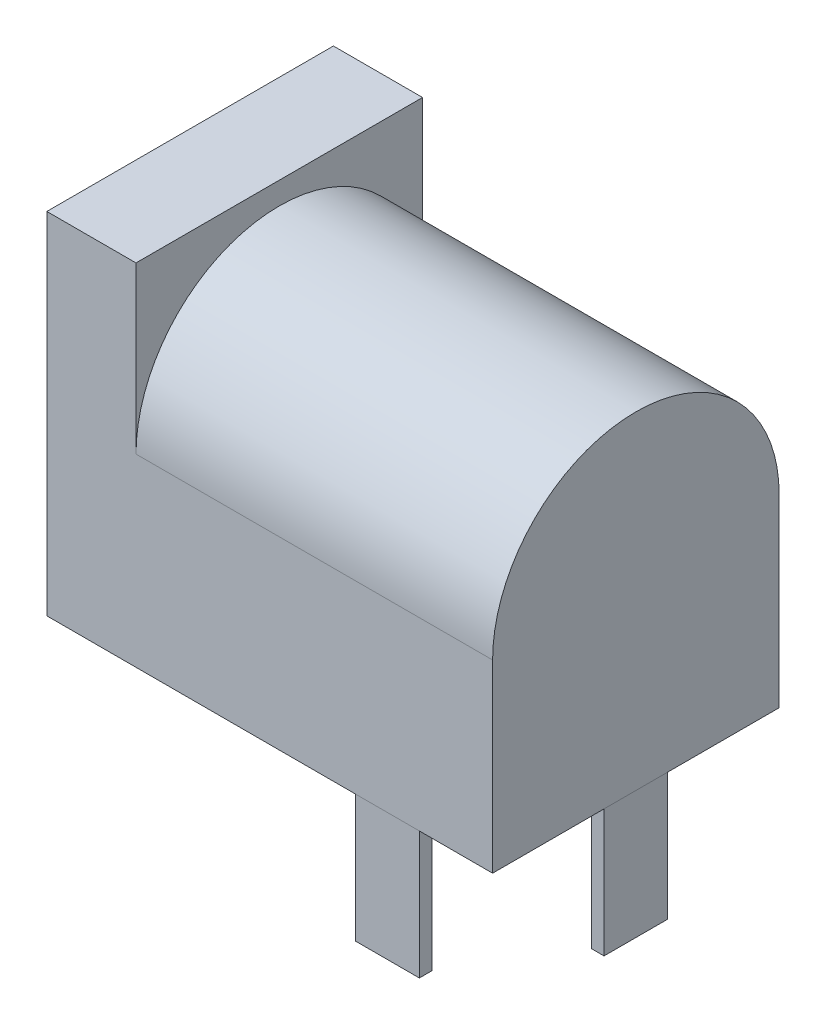
ISO-10303-21;
HEADER;
FILE_DESCRIPTION(('STEP AP214'),'2;1');
FILE_NAME('part.step','',(''),(''),'','','');
FILE_SCHEMA(('AUTOMOTIVE_DESIGN { 1 0 10303 214 1 1 1 1 }'));
ENDSEC;
DATA;
#1=APPLICATION_CONTEXT('core data for automotive mechanical design processes');
#2=APPLICATION_PROTOCOL_DEFINITION('international standard','automotive_design',2000,#1);
#3=PRODUCT_CONTEXT('',#1,'mechanical');
#4=PRODUCT('Part','Part','',(#3));
#5=PRODUCT_RELATED_PRODUCT_CATEGORY('part','',(#4));
#6=PRODUCT_DEFINITION_FORMATION('','',#4);
#7=PRODUCT_DEFINITION_CONTEXT('part definition',#1,'design');
#8=PRODUCT_DEFINITION('design','',#6,#7);
#9=PRODUCT_DEFINITION_SHAPE('','',#8);
#10=(LENGTH_UNIT() NAMED_UNIT(*) SI_UNIT(.MILLI.,.METRE.));
#11=(NAMED_UNIT(*) PLANE_ANGLE_UNIT() SI_UNIT($,.RADIAN.));
#12=(NAMED_UNIT(*) SI_UNIT($,.STERADIAN.) SOLID_ANGLE_UNIT());
#13=UNCERTAINTY_MEASURE_WITH_UNIT(LENGTH_MEASURE(1.E-05),#10,'distance_accuracy_value','');
#14=(GEOMETRIC_REPRESENTATION_CONTEXT(3) GLOBAL_UNCERTAINTY_ASSIGNED_CONTEXT((#13)) GLOBAL_UNIT_ASSIGNED_CONTEXT((#10,
#11,#12)) REPRESENTATION_CONTEXT('',''));
#15=CARTESIAN_POINT('',(0.,0.,0.));
#16=DIRECTION('',(0.,0.,1.));
#17=DIRECTION('',(1.,0.,0.));
#18=AXIS2_PLACEMENT_3D('',#15,#16,#17);
#19=CARTESIAN_POINT('',(7.4,-4.,1.));
#20=DIRECTION('',(1.,0.,0.));
#21=DIRECTION('',(0.,0.,-1.));
#22=AXIS2_PLACEMENT_3D('',#19,#20,#21);
#23=PLANE('',#22);
#24=DIRECTION('',(0.,0.,-1.));
#25=VECTOR('',#24,1.);
#26=CARTESIAN_POINT('',(7.4,0.,1.));
#27=LINE('',#26,#25);
#28=CARTESIAN_POINT('',(7.4,0.,1.));
#29=VERTEX_POINT('',#28);
#30=CARTESIAN_POINT('',(7.4,0.,-1.));
#31=VERTEX_POINT('',#30);
#32=EDGE_CURVE('E109',#29,#31,#27,.T.);
#33=ORIENTED_EDGE('',*,*,#32,.T.);
#34=DIRECTION('',(0.,1.,0.));
#35=VECTOR('',#34,1.);
#36=CARTESIAN_POINT('',(7.4,-4.,-1.));
#37=LINE('',#36,#35);
#38=CARTESIAN_POINT('',(7.4,-4.,-1.));
#39=VERTEX_POINT('',#38);
#40=EDGE_CURVE('E13',#39,#31,#37,.T.);
#41=ORIENTED_EDGE('',*,*,#40,.F.);
#42=DIRECTION('',(0.,0.,-1.));
#43=VECTOR('',#42,1.);
#44=CARTESIAN_POINT('',(7.4,-4.,1.));
#45=LINE('',#44,#43);
#46=CARTESIAN_POINT('',(7.4,-4.,1.));
#47=VERTEX_POINT('',#46);
#48=EDGE_CURVE('E97',#47,#39,#45,.T.);
#49=ORIENTED_EDGE('',*,*,#48,.F.);
#50=DIRECTION('',(0.,1.,0.));
#51=VECTOR('',#50,1.);
#52=CARTESIAN_POINT('',(7.4,-4.,1.));
#53=LINE('',#52,#51);
#54=EDGE_CURVE('E105',#47,#29,#53,.T.);
#55=ORIENTED_EDGE('',*,*,#54,.T.);
#56=EDGE_LOOP('',(#33,#41,#49,#55));
#57=FACE_BOUND('',#56,.T.);
#58=ADVANCED_FACE('F46',(#57),#23,.F.);
#59=CARTESIAN_POINT('',(7.4,-4.,-1.));
#60=DIRECTION('',(0.,0.,1.));
#61=DIRECTION('',(1.,0.,0.));
#62=AXIS2_PLACEMENT_3D('',#59,#60,#61);
#63=PLANE('',#62);
#64=DIRECTION('',(1.,0.,0.));
#65=VECTOR('',#64,1.);
#66=CARTESIAN_POINT('',(7.4,0.,-1.));
#67=LINE('',#66,#65);
#68=CARTESIAN_POINT('',(7.8,0.,-1.));
#69=VERTEX_POINT('',#68);
#70=EDGE_CURVE('E101',#31,#69,#67,.T.);
#71=ORIENTED_EDGE('',*,*,#70,.T.);
#72=DIRECTION('',(0.,1.,0.));
#73=VECTOR('',#72,1.);
#74=CARTESIAN_POINT('',(7.8,-4.,-1.));
#75=LINE('',#74,#73);
#76=CARTESIAN_POINT('',(7.8,-4.,-1.));
#77=VERTEX_POINT('',#76);
#78=EDGE_CURVE('E54',#77,#69,#75,.T.);
#79=ORIENTED_EDGE('',*,*,#78,.F.);
#80=DIRECTION('',(1.,0.,0.));
#81=VECTOR('',#80,1.);
#82=CARTESIAN_POINT('',(7.4,-4.,-1.));
#83=LINE('',#82,#81);
#84=EDGE_CURVE('E92',#39,#77,#83,.T.);
#85=ORIENTED_EDGE('',*,*,#84,.F.);
#86=ORIENTED_EDGE('',*,*,#40,.T.);
#87=EDGE_LOOP('',(#71,#79,#85,#86));
#88=FACE_BOUND('',#87,.T.);
#89=ADVANCED_FACE('F100',(#88),#63,.F.);
#90=CARTESIAN_POINT('',(7.8,-4.,1.));
#91=DIRECTION('',(-1.,0.,0.));
#92=DIRECTION('',(0.,0.,1.));
#93=AXIS2_PLACEMENT_3D('',#90,#91,#92);
#94=PLANE('',#93);
#95=DIRECTION('',(0.,0.,1.));
#96=VECTOR('',#95,1.);
#97=CARTESIAN_POINT('',(7.8,0.,1.));
#98=LINE('',#97,#96);
#99=CARTESIAN_POINT('',(7.8,0.,1.));
#100=VERTEX_POINT('',#99);
#101=EDGE_CURVE('E79',#69,#100,#98,.T.);
#102=ORIENTED_EDGE('',*,*,#101,.T.);
#103=DIRECTION('',(0.,1.,0.));
#104=VECTOR('',#103,1.);
#105=CARTESIAN_POINT('',(7.8,-4.,1.));
#106=LINE('',#105,#104);
#107=CARTESIAN_POINT('',(7.8,-4.,1.));
#108=VERTEX_POINT('',#107);
#109=EDGE_CURVE('E102',#108,#100,#106,.T.);
#110=ORIENTED_EDGE('',*,*,#109,.F.);
#111=DIRECTION('',(0.,0.,1.));
#112=VECTOR('',#111,1.);
#113=CARTESIAN_POINT('',(7.8,-4.,1.));
#114=LINE('',#113,#112);
#115=EDGE_CURVE('E95',#77,#108,#114,.T.);
#116=ORIENTED_EDGE('',*,*,#115,.F.);
#117=ORIENTED_EDGE('',*,*,#78,.T.);
#118=EDGE_LOOP('',(#102,#110,#116,#117));
#119=FACE_BOUND('',#118,.T.);
#120=ADVANCED_FACE('F103',(#119),#94,.F.);
#121=CARTESIAN_POINT('',(7.4,-4.,1.));
#122=DIRECTION('',(0.,0.,-1.));
#123=DIRECTION('',(-1.,0.,0.));
#124=AXIS2_PLACEMENT_3D('',#121,#122,#123);
#125=PLANE('',#124);
#126=DIRECTION('',(-1.,0.,0.));
#127=VECTOR('',#126,1.);
#128=CARTESIAN_POINT('',(7.4,0.,1.));
#129=LINE('',#128,#127);
#130=EDGE_CURVE('E85',#100,#29,#129,.T.);
#131=ORIENTED_EDGE('',*,*,#130,.T.);
#132=ORIENTED_EDGE('',*,*,#54,.F.);
#133=DIRECTION('',(-1.,0.,0.));
#134=VECTOR('',#133,1.);
#135=CARTESIAN_POINT('',(7.4,-4.,1.));
#136=LINE('',#135,#134);
#137=EDGE_CURVE('E62',#108,#47,#136,.T.);
#138=ORIENTED_EDGE('',*,*,#137,.F.);
#139=ORIENTED_EDGE('',*,*,#109,.T.);
#140=EDGE_LOOP('',(#131,#132,#138,#139));
#141=FACE_BOUND('',#140,.T.);
#142=ADVANCED_FACE('F116',(#141),#125,.F.);
#143=CARTESIAN_POINT('',(0.,-4.,0.));
#144=DIRECTION('',(0.,-1.,0.));
#145=DIRECTION('',(0.,0.,-1.));
#146=AXIS2_PLACEMENT_3D('',#143,#144,#145);
#147=PLANE('',#146);
#148=ORIENTED_EDGE('',*,*,#48,.T.);
#149=ORIENTED_EDGE('',*,*,#84,.T.);
#150=ORIENTED_EDGE('',*,*,#115,.T.);
#151=ORIENTED_EDGE('',*,*,#137,.T.);
#152=EDGE_LOOP('',(#148,#149,#150,#151));
#153=FACE_BOUND('',#152,.T.);
#154=ADVANCED_FACE('F93',(#153),#147,.T.);
#155=CARTESIAN_POINT('',(0.,0.,0.));
#156=DIRECTION('',(0.,-1.,0.));
#157=DIRECTION('',(0.,0.,-1.));
#158=AXIS2_PLACEMENT_3D('',#155,#156,#157);
#159=PLANE('',#158);
#160=ORIENTED_EDGE('',*,*,#32,.F.);
#161=ORIENTED_EDGE('',*,*,#130,.F.);
#162=ORIENTED_EDGE('',*,*,#101,.F.);
#163=ORIENTED_EDGE('',*,*,#70,.F.);
#164=EDGE_LOOP('',(#160,#161,#162,#163));
#165=FACE_BOUND('',#164,.T.);
#166=ADVANCED_FACE('F119',(#165),#159,.F.);
#167=CLOSED_SHELL('',(#58,#89,#120,#142,#154,#166));
#168=MANIFOLD_SOLID_BREP('B2',#167);
#169=CARTESIAN_POINT('',(14.,-4.,1.));
#170=DIRECTION('',(-1.,0.,0.));
#171=DIRECTION('',(0.,0.,1.));
#172=AXIS2_PLACEMENT_3D('',#169,#170,#171);
#173=PLANE('',#172);
#174=DIRECTION('',(0.,0.,1.));
#175=VECTOR('',#174,1.);
#176=CARTESIAN_POINT('',(14.,0.,1.));
#177=LINE('',#176,#175);
#178=CARTESIAN_POINT('',(14.,0.,-1.));
#179=VERTEX_POINT('',#178);
#180=CARTESIAN_POINT('',(14.,0.,1.));
#181=VERTEX_POINT('',#180);
#182=EDGE_CURVE('E242',#179,#181,#177,.T.);
#183=ORIENTED_EDGE('',*,*,#182,.T.);
#184=DIRECTION('',(0.,1.,0.));
#185=VECTOR('',#184,1.);
#186=CARTESIAN_POINT('',(14.,-4.,1.));
#187=LINE('',#186,#185);
#188=CARTESIAN_POINT('',(14.,-4.,1.));
#189=VERTEX_POINT('',#188);
#190=EDGE_CURVE('E44',#189,#181,#187,.T.);
#191=ORIENTED_EDGE('',*,*,#190,.F.);
#192=DIRECTION('',(0.,0.,1.));
#193=VECTOR('',#192,1.);
#194=CARTESIAN_POINT('',(14.,-4.,1.));
#195=LINE('',#194,#193);
#196=CARTESIAN_POINT('',(14.,-4.,-1.));
#197=VERTEX_POINT('',#196);
#198=EDGE_CURVE('E230',#197,#189,#195,.T.);
#199=ORIENTED_EDGE('',*,*,#198,.F.);
#200=DIRECTION('',(0.,1.,0.));
#201=VECTOR('',#200,1.);
#202=CARTESIAN_POINT('',(14.,-4.,-1.));
#203=LINE('',#202,#201);
#204=EDGE_CURVE('E238',#197,#179,#203,.T.);
#205=ORIENTED_EDGE('',*,*,#204,.T.);
#206=EDGE_LOOP('',(#183,#191,#199,#205));
#207=FACE_BOUND('',#206,.T.);
#208=ADVANCED_FACE('F179',(#207),#173,.F.);
#209=CARTESIAN_POINT('',(14.,-4.,1.));
#210=DIRECTION('',(0.,0.,-1.));
#211=DIRECTION('',(-1.,0.,0.));
#212=AXIS2_PLACEMENT_3D('',#209,#210,#211);
#213=PLANE('',#212);
#214=DIRECTION('',(-1.,0.,0.));
#215=VECTOR('',#214,1.);
#216=CARTESIAN_POINT('',(14.,0.,1.));
#217=LINE('',#216,#215);
#218=CARTESIAN_POINT('',(13.6,0.,1.));
#219=VERTEX_POINT('',#218);
#220=EDGE_CURVE('E234',#181,#219,#217,.T.);
#221=ORIENTED_EDGE('',*,*,#220,.T.);
#222=DIRECTION('',(0.,1.,0.));
#223=VECTOR('',#222,1.);
#224=CARTESIAN_POINT('',(13.6,-4.,1.));
#225=LINE('',#224,#223);
#226=CARTESIAN_POINT('',(13.6,-4.,1.));
#227=VERTEX_POINT('',#226);
#228=EDGE_CURVE('E187',#227,#219,#225,.T.);
#229=ORIENTED_EDGE('',*,*,#228,.F.);
#230=DIRECTION('',(-1.,0.,0.));
#231=VECTOR('',#230,1.);
#232=CARTESIAN_POINT('',(14.,-4.,1.));
#233=LINE('',#232,#231);
#234=EDGE_CURVE('E225',#189,#227,#233,.T.);
#235=ORIENTED_EDGE('',*,*,#234,.F.);
#236=ORIENTED_EDGE('',*,*,#190,.T.);
#237=EDGE_LOOP('',(#221,#229,#235,#236));
#238=FACE_BOUND('',#237,.T.);
#239=ADVANCED_FACE('F233',(#238),#213,.F.);
#240=CARTESIAN_POINT('',(13.6,-4.,1.));
#241=DIRECTION('',(1.,0.,0.));
#242=DIRECTION('',(0.,0.,-1.));
#243=AXIS2_PLACEMENT_3D('',#240,#241,#242);
#244=PLANE('',#243);
#245=DIRECTION('',(0.,0.,-1.));
#246=VECTOR('',#245,1.);
#247=CARTESIAN_POINT('',(13.6,0.,1.));
#248=LINE('',#247,#246);
#249=CARTESIAN_POINT('',(13.6,0.,-1.));
#250=VERTEX_POINT('',#249);
#251=EDGE_CURVE('E212',#219,#250,#248,.T.);
#252=ORIENTED_EDGE('',*,*,#251,.T.);
#253=DIRECTION('',(0.,1.,0.));
#254=VECTOR('',#253,1.);
#255=CARTESIAN_POINT('',(13.6,-4.,-1.));
#256=LINE('',#255,#254);
#257=CARTESIAN_POINT('',(13.6,-4.,-1.));
#258=VERTEX_POINT('',#257);
#259=EDGE_CURVE('E235',#258,#250,#256,.T.);
#260=ORIENTED_EDGE('',*,*,#259,.F.);
#261=DIRECTION('',(0.,0.,-1.));
#262=VECTOR('',#261,1.);
#263=CARTESIAN_POINT('',(13.6,-4.,1.));
#264=LINE('',#263,#262);
#265=EDGE_CURVE('E228',#227,#258,#264,.T.);
#266=ORIENTED_EDGE('',*,*,#265,.F.);
#267=ORIENTED_EDGE('',*,*,#228,.T.);
#268=EDGE_LOOP('',(#252,#260,#266,#267));
#269=FACE_BOUND('',#268,.T.);
#270=ADVANCED_FACE('F236',(#269),#244,.F.);
#271=CARTESIAN_POINT('',(14.,-4.,-1.));
#272=DIRECTION('',(0.,0.,1.));
#273=DIRECTION('',(1.,0.,0.));
#274=AXIS2_PLACEMENT_3D('',#271,#272,#273);
#275=PLANE('',#274);
#276=DIRECTION('',(1.,0.,0.));
#277=VECTOR('',#276,1.);
#278=CARTESIAN_POINT('',(14.,0.,-1.));
#279=LINE('',#278,#277);
#280=EDGE_CURVE('E218',#250,#179,#279,.T.);
#281=ORIENTED_EDGE('',*,*,#280,.T.);
#282=ORIENTED_EDGE('',*,*,#204,.F.);
#283=DIRECTION('',(1.,0.,0.));
#284=VECTOR('',#283,1.);
#285=CARTESIAN_POINT('',(14.,-4.,-1.));
#286=LINE('',#285,#284);
#287=EDGE_CURVE('E195',#258,#197,#286,.T.);
#288=ORIENTED_EDGE('',*,*,#287,.F.);
#289=ORIENTED_EDGE('',*,*,#259,.T.);
#290=EDGE_LOOP('',(#281,#282,#288,#289));
#291=FACE_BOUND('',#290,.T.);
#292=ADVANCED_FACE('F249',(#291),#275,.F.);
#293=CARTESIAN_POINT('',(0.,-4.,0.));
#294=DIRECTION('',(0.,1.,0.));
#295=DIRECTION('',(0.,0.,1.));
#296=AXIS2_PLACEMENT_3D('',#293,#294,#295);
#297=PLANE('',#296);
#298=ORIENTED_EDGE('',*,*,#198,.T.);
#299=ORIENTED_EDGE('',*,*,#234,.T.);
#300=ORIENTED_EDGE('',*,*,#265,.T.);
#301=ORIENTED_EDGE('',*,*,#287,.T.);
#302=EDGE_LOOP('',(#298,#299,#300,#301));
#303=FACE_BOUND('',#302,.T.);
#304=ADVANCED_FACE('F226',(#303),#297,.F.);
#305=CARTESIAN_POINT('',(0.,0.,0.));
#306=DIRECTION('',(0.,1.,0.));
#307=DIRECTION('',(0.,0.,1.));
#308=AXIS2_PLACEMENT_3D('',#305,#306,#307);
#309=PLANE('',#308);
#310=ORIENTED_EDGE('',*,*,#182,.F.);
#311=ORIENTED_EDGE('',*,*,#280,.F.);
#312=ORIENTED_EDGE('',*,*,#251,.F.);
#313=ORIENTED_EDGE('',*,*,#220,.F.);
#314=EDGE_LOOP('',(#310,#311,#312,#313));
#315=FACE_BOUND('',#314,.T.);
#316=ADVANCED_FACE('F252',(#315),#309,.T.);
#317=CLOSED_SHELL('',(#208,#239,#270,#292,#304,#316));
#318=MANIFOLD_SOLID_BREP('B7',#317);
#319=CARTESIAN_POINT('',(9.7,-4.,4.5));
#320=DIRECTION('',(1.,0.,0.));
#321=DIRECTION('',(0.,0.,-1.));
#322=AXIS2_PLACEMENT_3D('',#319,#320,#321);
#323=PLANE('',#322);
#324=DIRECTION('',(0.,0.,-1.));
#325=VECTOR('',#324,1.);
#326=CARTESIAN_POINT('',(9.7,0.,4.5));
#327=LINE('',#326,#325);
#328=CARTESIAN_POINT('',(9.7,0.,4.5));
#329=VERTEX_POINT('',#328);
#330=CARTESIAN_POINT('',(9.7,0.,4.1));
#331=VERTEX_POINT('',#330);
#332=EDGE_CURVE('E374',#329,#331,#327,.T.);
#333=ORIENTED_EDGE('',*,*,#332,.T.);
#334=DIRECTION('',(0.,1.,0.));
#335=VECTOR('',#334,1.);
#336=CARTESIAN_POINT('',(9.7,-4.,4.1));
#337=LINE('',#336,#335);
#338=CARTESIAN_POINT('',(9.7,-4.,4.1));
#339=VERTEX_POINT('',#338);
#340=EDGE_CURVE('E177',#339,#331,#337,.T.);
#341=ORIENTED_EDGE('',*,*,#340,.F.);
#342=DIRECTION('',(0.,0.,-1.));
#343=VECTOR('',#342,1.);
#344=CARTESIAN_POINT('',(9.7,-4.,4.5));
#345=LINE('',#344,#343);
#346=CARTESIAN_POINT('',(9.7,-4.,4.5));
#347=VERTEX_POINT('',#346);
#348=EDGE_CURVE('E362',#347,#339,#345,.T.);
#349=ORIENTED_EDGE('',*,*,#348,.F.);
#350=DIRECTION('',(0.,1.,0.));
#351=VECTOR('',#350,1.);
#352=CARTESIAN_POINT('',(9.7,-4.,4.5));
#353=LINE('',#352,#351);
#354=EDGE_CURVE('E370',#347,#329,#353,.T.);
#355=ORIENTED_EDGE('',*,*,#354,.T.);
#356=EDGE_LOOP('',(#333,#341,#349,#355));
#357=FACE_BOUND('',#356,.T.);
#358=ADVANCED_FACE('F311',(#357),#323,.F.);
#359=CARTESIAN_POINT('',(9.7,-4.,4.1));
#360=DIRECTION('',(0.,0.,1.));
#361=DIRECTION('',(1.,0.,0.));
#362=AXIS2_PLACEMENT_3D('',#359,#360,#361);
#363=PLANE('',#362);
#364=DIRECTION('',(1.,0.,0.));
#365=VECTOR('',#364,1.);
#366=CARTESIAN_POINT('',(9.7,0.,4.1));
#367=LINE('',#366,#365);
#368=CARTESIAN_POINT('',(11.7,0.,4.1));
#369=VERTEX_POINT('',#368);
#370=EDGE_CURVE('E366',#331,#369,#367,.T.);
#371=ORIENTED_EDGE('',*,*,#370,.T.);
#372=DIRECTION('',(0.,1.,0.));
#373=VECTOR('',#372,1.);
#374=CARTESIAN_POINT('',(11.7,-4.,4.1));
#375=LINE('',#374,#373);
#376=CARTESIAN_POINT('',(11.7,-4.,4.1));
#377=VERTEX_POINT('',#376);
#378=EDGE_CURVE('E319',#377,#369,#375,.T.);
#379=ORIENTED_EDGE('',*,*,#378,.F.);
#380=DIRECTION('',(1.,0.,0.));
#381=VECTOR('',#380,1.);
#382=CARTESIAN_POINT('',(9.7,-4.,4.1));
#383=LINE('',#382,#381);
#384=EDGE_CURVE('E357',#339,#377,#383,.T.);
#385=ORIENTED_EDGE('',*,*,#384,.F.);
#386=ORIENTED_EDGE('',*,*,#340,.T.);
#387=EDGE_LOOP('',(#371,#379,#385,#386));
#388=FACE_BOUND('',#387,.T.);
#389=ADVANCED_FACE('F365',(#388),#363,.F.);
#390=CARTESIAN_POINT('',(11.7,-4.,4.5));
#391=DIRECTION('',(-1.,0.,0.));
#392=DIRECTION('',(0.,0.,1.));
#393=AXIS2_PLACEMENT_3D('',#390,#391,#392);
#394=PLANE('',#393);
#395=DIRECTION('',(0.,0.,1.));
#396=VECTOR('',#395,1.);
#397=CARTESIAN_POINT('',(11.7,0.,4.5));
#398=LINE('',#397,#396);
#399=CARTESIAN_POINT('',(11.7,0.,4.5));
#400=VERTEX_POINT('',#399);
#401=EDGE_CURVE('E344',#369,#400,#398,.T.);
#402=ORIENTED_EDGE('',*,*,#401,.T.);
#403=DIRECTION('',(0.,1.,0.));
#404=VECTOR('',#403,1.);
#405=CARTESIAN_POINT('',(11.7,-4.,4.5));
#406=LINE('',#405,#404);
#407=CARTESIAN_POINT('',(11.7,-4.,4.5));
#408=VERTEX_POINT('',#407);
#409=EDGE_CURVE('E367',#408,#400,#406,.T.);
#410=ORIENTED_EDGE('',*,*,#409,.F.);
#411=DIRECTION('',(0.,0.,1.));
#412=VECTOR('',#411,1.);
#413=CARTESIAN_POINT('',(11.7,-4.,4.5));
#414=LINE('',#413,#412);
#415=EDGE_CURVE('E360',#377,#408,#414,.T.);
#416=ORIENTED_EDGE('',*,*,#415,.F.);
#417=ORIENTED_EDGE('',*,*,#378,.T.);
#418=EDGE_LOOP('',(#402,#410,#416,#417));
#419=FACE_BOUND('',#418,.T.);
#420=ADVANCED_FACE('F368',(#419),#394,.F.);
#421=CARTESIAN_POINT('',(9.7,-4.,4.5));
#422=DIRECTION('',(0.,0.,-1.));
#423=DIRECTION('',(-1.,0.,0.));
#424=AXIS2_PLACEMENT_3D('',#421,#422,#423);
#425=PLANE('',#424);
#426=DIRECTION('',(-1.,0.,0.));
#427=VECTOR('',#426,1.);
#428=CARTESIAN_POINT('',(9.7,0.,4.5));
#429=LINE('',#428,#427);
#430=EDGE_CURVE('E350',#400,#329,#429,.T.);
#431=ORIENTED_EDGE('',*,*,#430,.T.);
#432=ORIENTED_EDGE('',*,*,#354,.F.);
#433=DIRECTION('',(-1.,0.,0.));
#434=VECTOR('',#433,1.);
#435=CARTESIAN_POINT('',(9.7,-4.,4.5));
#436=LINE('',#435,#434);
#437=EDGE_CURVE('E327',#408,#347,#436,.T.);
#438=ORIENTED_EDGE('',*,*,#437,.F.);
#439=ORIENTED_EDGE('',*,*,#409,.T.);
#440=EDGE_LOOP('',(#431,#432,#438,#439));
#441=FACE_BOUND('',#440,.T.);
#442=ADVANCED_FACE('F381',(#441),#425,.F.);
#443=CARTESIAN_POINT('',(0.,-4.,0.));
#444=DIRECTION('',(0.,-1.,0.));
#445=DIRECTION('',(0.,0.,-1.));
#446=AXIS2_PLACEMENT_3D('',#443,#444,#445);
#447=PLANE('',#446);
#448=ORIENTED_EDGE('',*,*,#348,.T.);
#449=ORIENTED_EDGE('',*,*,#384,.T.);
#450=ORIENTED_EDGE('',*,*,#415,.T.);
#451=ORIENTED_EDGE('',*,*,#437,.T.);
#452=EDGE_LOOP('',(#448,#449,#450,#451));
#453=FACE_BOUND('',#452,.T.);
#454=ADVANCED_FACE('F358',(#453),#447,.T.);
#455=CARTESIAN_POINT('',(0.,0.,0.));
#456=DIRECTION('',(0.,-1.,0.));
#457=DIRECTION('',(0.,0.,-1.));
#458=AXIS2_PLACEMENT_3D('',#455,#456,#457);
#459=PLANE('',#458);
#460=ORIENTED_EDGE('',*,*,#332,.F.);
#461=ORIENTED_EDGE('',*,*,#430,.F.);
#462=ORIENTED_EDGE('',*,*,#401,.F.);
#463=ORIENTED_EDGE('',*,*,#370,.F.);
#464=EDGE_LOOP('',(#460,#461,#462,#463));
#465=FACE_BOUND('',#464,.T.);
#466=ADVANCED_FACE('F384',(#465),#459,.F.);
#467=CLOSED_SHELL('',(#358,#389,#420,#442,#454,#466));
#468=MANIFOLD_SOLID_BREP('B38',#467);
#469=CARTESIAN_POINT('',(14.,5.8,0.));
#470=DIRECTION('',(-1.,0.,0.));
#471=DIRECTION('',(0.,0.,1.));
#472=AXIS2_PLACEMENT_3D('',#469,#470,#471);
#473=CYLINDRICAL_SURFACE('',#472,4.5);
#474=CARTESIAN_POINT('',(2.8,5.8,0.));
#475=DIRECTION('',(-1.,0.,0.));
#476=DIRECTION('',(0.,0.,1.));
#477=AXIS2_PLACEMENT_3D('',#474,#475,#476);
#478=CIRCLE('',#477,4.5);
#479=CARTESIAN_POINT('',(2.8,5.8,4.5));
#480=VERTEX_POINT('',#479);
#481=CARTESIAN_POINT('',(2.8,5.8,-4.5));
#482=VERTEX_POINT('',#481);
#483=EDGE_CURVE('E453',#480,#482,#478,.T.);
#484=ORIENTED_EDGE('',*,*,#483,.F.);
#485=DIRECTION('',(-1.,0.,0.));
#486=VECTOR('',#485,1.);
#487=CARTESIAN_POINT('',(14.,5.8,4.5));
#488=LINE('',#487,#486);
#489=CARTESIAN_POINT('',(14.,5.8,4.5));
#490=VERTEX_POINT('',#489);
#491=EDGE_CURVE('E539',#490,#480,#488,.T.);
#492=ORIENTED_EDGE('',*,*,#491,.F.);
#493=CARTESIAN_POINT('',(14.,5.8,0.));
#494=DIRECTION('',(1.,0.,0.));
#495=DIRECTION('',(0.,0.,-1.));
#496=AXIS2_PLACEMENT_3D('',#493,#494,#495);
#497=CIRCLE('',#496,4.5);
#498=CARTESIAN_POINT('',(14.,5.8,-4.5));
#499=VERTEX_POINT('',#498);
#500=EDGE_CURVE('E522',#499,#490,#497,.T.);
#501=ORIENTED_EDGE('',*,*,#500,.F.);
#502=DIRECTION('',(-1.,0.,0.));
#503=VECTOR('',#502,1.);
#504=CARTESIAN_POINT('',(14.,5.8,-4.5));
#505=LINE('',#504,#503);
#506=EDGE_CURVE('E449',#499,#482,#505,.T.);
#507=ORIENTED_EDGE('',*,*,#506,.T.);
#508=EDGE_LOOP('',(#484,#492,#501,#507));
#509=FACE_BOUND('',#508,.T.);
#510=ADVANCED_FACE('F434',(#509),#473,.T.);
#511=CARTESIAN_POINT('',(14.,0.,-4.5));
#512=DIRECTION('',(0.,0.,-1.));
#513=DIRECTION('',(0.,1.,0.));
#514=AXIS2_PLACEMENT_3D('',#511,#512,#513);
#515=PLANE('',#514);
#516=DIRECTION('',(0.,-1.,0.));
#517=VECTOR('',#516,1.);
#518=CARTESIAN_POINT('',(2.8,11.,-4.5));
#519=LINE('',#518,#517);
#520=CARTESIAN_POINT('',(2.8,11.,-4.5));
#521=VERTEX_POINT('',#520);
#522=EDGE_CURVE('E489',#521,#482,#519,.T.);
#523=ORIENTED_EDGE('',*,*,#522,.T.);
#524=ORIENTED_EDGE('',*,*,#506,.F.);
#525=DIRECTION('',(0.,-1.,0.));
#526=VECTOR('',#525,1.);
#527=CARTESIAN_POINT('',(14.,0.,-4.5));
#528=LINE('',#527,#526);
#529=CARTESIAN_POINT('',(14.,0.,-4.5));
#530=VERTEX_POINT('',#529);
#531=EDGE_CURVE('E519',#499,#530,#528,.T.);
#532=ORIENTED_EDGE('',*,*,#531,.T.);
#533=DIRECTION('',(-1.,0.,0.));
#534=VECTOR('',#533,1.);
#535=CARTESIAN_POINT('',(14.,0.,-4.5));
#536=LINE('',#535,#534);
#537=CARTESIAN_POINT('',(0.,0.,-4.5));
#538=VERTEX_POINT('',#537);
#539=EDGE_CURVE('E529',#530,#538,#536,.T.);
#540=ORIENTED_EDGE('',*,*,#539,.T.);
#541=DIRECTION('',(0.,-1.,0.));
#542=VECTOR('',#541,1.);
#543=CARTESIAN_POINT('',(0.,0.,-4.5));
#544=LINE('',#543,#542);
#545=CARTESIAN_POINT('',(0.,11.,-4.5));
#546=VERTEX_POINT('',#545);
#547=EDGE_CURVE('E491',#546,#538,#544,.T.);
#548=ORIENTED_EDGE('',*,*,#547,.F.);
#549=DIRECTION('',(-1.,0.,0.));
#550=VECTOR('',#549,1.);
#551=CARTESIAN_POINT('',(2.8,11.,-4.5));
#552=LINE('',#551,#550);
#553=EDGE_CURVE('E486',#521,#546,#552,.T.);
#554=ORIENTED_EDGE('',*,*,#553,.F.);
#555=EDGE_LOOP('',(#523,#524,#532,#540,#548,#554));
#556=FACE_BOUND('',#555,.T.);
#557=ADVANCED_FACE('F488',(#556),#515,.T.);
#558=CARTESIAN_POINT('',(14.,0.,4.5));
#559=DIRECTION('',(0.,0.,-1.));
#560=DIRECTION('',(0.,1.,0.));
#561=AXIS2_PLACEMENT_3D('',#558,#559,#560);
#562=PLANE('',#561);
#563=DIRECTION('',(0.,-1.,0.));
#564=VECTOR('',#563,1.);
#565=CARTESIAN_POINT('',(0.,0.,4.5));
#566=LINE('',#565,#564);
#567=CARTESIAN_POINT('',(0.,11.,4.5));
#568=VERTEX_POINT('',#567);
#569=CARTESIAN_POINT('',(0.,0.,4.5));
#570=VERTEX_POINT('',#569);
#571=EDGE_CURVE('E531',#568,#570,#566,.T.);
#572=ORIENTED_EDGE('',*,*,#571,.T.);
#573=DIRECTION('',(-1.,0.,0.));
#574=VECTOR('',#573,1.);
#575=CARTESIAN_POINT('',(14.,0.,4.5));
#576=LINE('',#575,#574);
#577=CARTESIAN_POINT('',(14.,0.,4.5));
#578=VERTEX_POINT('',#577);
#579=EDGE_CURVE('E537',#578,#570,#576,.T.);
#580=ORIENTED_EDGE('',*,*,#579,.F.);
#581=DIRECTION('',(0.,-1.,0.));
#582=VECTOR('',#581,1.);
#583=CARTESIAN_POINT('',(14.,0.,4.5));
#584=LINE('',#583,#582);
#585=EDGE_CURVE('E525',#490,#578,#584,.T.);
#586=ORIENTED_EDGE('',*,*,#585,.F.);
#587=ORIENTED_EDGE('',*,*,#491,.T.);
#588=DIRECTION('',(0.,-1.,0.));
#589=VECTOR('',#588,1.);
#590=CARTESIAN_POINT('',(2.8,11.,4.5));
#591=LINE('',#590,#589);
#592=CARTESIAN_POINT('',(2.8,11.,4.5));
#593=VERTEX_POINT('',#592);
#594=EDGE_CURVE('E497',#593,#480,#591,.T.);
#595=ORIENTED_EDGE('',*,*,#594,.F.);
#596=DIRECTION('',(-1.,0.,0.));
#597=VECTOR('',#596,1.);
#598=CARTESIAN_POINT('',(2.8,11.,4.5));
#599=LINE('',#598,#597);
#600=EDGE_CURVE('E496',#593,#568,#599,.T.);
#601=ORIENTED_EDGE('',*,*,#600,.T.);
#602=EDGE_LOOP('',(#572,#580,#586,#587,#595,#601));
#603=FACE_BOUND('',#602,.T.);
#604=ADVANCED_FACE('F558',(#603),#562,.F.);
#605=CARTESIAN_POINT('',(14.,0.,0.));
#606=DIRECTION('',(0.,1.,0.));
#607=DIRECTION('',(0.,0.,1.));
#608=AXIS2_PLACEMENT_3D('',#605,#606,#607);
#609=PLANE('',#608);
#610=DIRECTION('',(0.,0.,-1.));
#611=VECTOR('',#610,1.);
#612=CARTESIAN_POINT('',(0.,0.,0.));
#613=LINE('',#612,#611);
#614=EDGE_CURVE('E523',#570,#538,#613,.T.);
#615=ORIENTED_EDGE('',*,*,#614,.T.);
#616=ORIENTED_EDGE('',*,*,#539,.F.);
#617=DIRECTION('',(0.,0.,-1.));
#618=VECTOR('',#617,1.);
#619=CARTESIAN_POINT('',(14.,0.,0.));
#620=LINE('',#619,#618);
#621=EDGE_CURVE('E527',#578,#530,#620,.T.);
#622=ORIENTED_EDGE('',*,*,#621,.F.);
#623=ORIENTED_EDGE('',*,*,#579,.T.);
#624=EDGE_LOOP('',(#615,#616,#622,#623));
#625=FACE_BOUND('',#624,.T.);
#626=ADVANCED_FACE('F563',(#625),#609,.F.);
#627=CARTESIAN_POINT('',(14.,0.,0.));
#628=DIRECTION('',(1.,0.,0.));
#629=DIRECTION('',(0.,0.,-1.));
#630=AXIS2_PLACEMENT_3D('',#627,#628,#629);
#631=PLANE('',#630);
#632=ORIENTED_EDGE('',*,*,#531,.F.);
#633=ORIENTED_EDGE('',*,*,#500,.T.);
#634=ORIENTED_EDGE('',*,*,#585,.T.);
#635=ORIENTED_EDGE('',*,*,#621,.T.);
#636=EDGE_LOOP('',(#632,#633,#634,#635));
#637=FACE_BOUND('',#636,.T.);
#638=ADVANCED_FACE('F567',(#637),#631,.T.);
#639=CARTESIAN_POINT('',(0.,0.,0.));
#640=DIRECTION('',(1.,0.,0.));
#641=DIRECTION('',(0.,0.,-1.));
#642=AXIS2_PLACEMENT_3D('',#639,#640,#641);
#643=PLANE('',#642);
#644=CARTESIAN_POINT('',(0.,5.8,0.));
#645=DIRECTION('',(-1.,0.,0.));
#646=DIRECTION('',(0.,0.,1.));
#647=AXIS2_PLACEMENT_3D('',#644,#645,#646);
#648=CIRCLE('',#647,3.);
#649=CARTESIAN_POINT('',(0.,5.8,3.));
#650=VERTEX_POINT('',#649);
#651=EDGE_CURVE('E513',#650,#650,#648,.T.);
#652=ORIENTED_EDGE('',*,*,#651,.F.);
#653=EDGE_LOOP('',(#652));
#654=FACE_BOUND('',#653,.T.);
#655=ORIENTED_EDGE('',*,*,#547,.T.);
#656=ORIENTED_EDGE('',*,*,#614,.F.);
#657=ORIENTED_EDGE('',*,*,#571,.F.);
#658=DIRECTION('',(0.,0.,-1.));
#659=VECTOR('',#658,1.);
#660=CARTESIAN_POINT('',(0.,11.,4.5));
#661=LINE('',#660,#659);
#662=EDGE_CURVE('E508',#568,#546,#661,.T.);
#663=ORIENTED_EDGE('',*,*,#662,.T.);
#664=EDGE_LOOP('',(#655,#656,#657,#663));
#665=FACE_BOUND('',#664,.T.);
#666=ADVANCED_FACE('F569',(#654,#665),#643,.F.);
#667=CARTESIAN_POINT('',(2.8,0.,0.));
#668=DIRECTION('',(-1.,0.,0.));
#669=DIRECTION('',(0.,0.,1.));
#670=AXIS2_PLACEMENT_3D('',#667,#668,#669);
#671=PLANE('',#670);
#672=ORIENTED_EDGE('',*,*,#594,.T.);
#673=ORIENTED_EDGE('',*,*,#483,.T.);
#674=ORIENTED_EDGE('',*,*,#522,.F.);
#675=DIRECTION('',(0.,0.,-1.));
#676=VECTOR('',#675,1.);
#677=CARTESIAN_POINT('',(2.8,11.,4.5));
#678=LINE('',#677,#676);
#679=EDGE_CURVE('E503',#593,#521,#678,.T.);
#680=ORIENTED_EDGE('',*,*,#679,.F.);
#681=EDGE_LOOP('',(#672,#673,#674,#680));
#682=FACE_BOUND('',#681,.T.);
#683=ADVANCED_FACE('F502',(#682),#671,.F.);
#684=CARTESIAN_POINT('',(2.8,11.,4.5));
#685=DIRECTION('',(0.,1.,0.));
#686=DIRECTION('',(0.,0.,1.));
#687=AXIS2_PLACEMENT_3D('',#684,#685,#686);
#688=PLANE('',#687);
#689=ORIENTED_EDGE('',*,*,#662,.F.);
#690=ORIENTED_EDGE('',*,*,#600,.F.);
#691=ORIENTED_EDGE('',*,*,#679,.T.);
#692=ORIENTED_EDGE('',*,*,#553,.T.);
#693=EDGE_LOOP('',(#689,#690,#691,#692));
#694=FACE_BOUND('',#693,.T.);
#695=ADVANCED_FACE('F505',(#694),#688,.T.);
#696=CARTESIAN_POINT('',(11.8,5.8,0.));
#697=DIRECTION('',(-1.,0.,0.));
#698=DIRECTION('',(0.,0.,1.));
#699=AXIS2_PLACEMENT_3D('',#696,#697,#698);
#700=CYLINDRICAL_SURFACE('',#699,3.);
#701=CARTESIAN_POINT('',(11.8,5.8,0.));
#702=DIRECTION('',(-1.,0.,0.));
#703=DIRECTION('',(0.,0.,1.));
#704=AXIS2_PLACEMENT_3D('',#701,#702,#703);
#705=CIRCLE('',#704,3.);
#706=CARTESIAN_POINT('',(11.8,5.8,3.));
#707=VERTEX_POINT('',#706);
#708=EDGE_CURVE('E510',#707,#707,#705,.T.);
#709=ORIENTED_EDGE('',*,*,#708,.F.);
#710=EDGE_LOOP('',(#709));
#711=FACE_BOUND('',#710,.T.);
#712=ORIENTED_EDGE('',*,*,#651,.T.);
#713=EDGE_LOOP('',(#712));
#714=FACE_BOUND('',#713,.T.);
#715=ADVANCED_FACE('F578',(#711,#714),#700,.F.);
#716=CARTESIAN_POINT('',(11.8,5.8,0.));
#717=DIRECTION('',(-1.,0.,0.));
#718=DIRECTION('',(0.,0.,1.));
#719=AXIS2_PLACEMENT_3D('',#716,#717,#718);
#720=PLANE('',#719);
#721=CARTESIAN_POINT('',(11.8,5.8,0.));
#722=DIRECTION('',(-1.,0.,0.));
#723=DIRECTION('',(0.,0.,1.));
#724=AXIS2_PLACEMENT_3D('',#721,#722,#723);
#725=CIRCLE('',#724,0.8);
#726=CARTESIAN_POINT('',(11.8,5.8,0.8));
#727=VERTEX_POINT('',#726);
#728=EDGE_CURVE('E595',#727,#727,#725,.T.);
#729=ORIENTED_EDGE('',*,*,#728,.F.);
#730=EDGE_LOOP('',(#729));
#731=FACE_BOUND('',#730,.T.);
#732=ORIENTED_EDGE('',*,*,#708,.T.);
#733=EDGE_LOOP('',(#732));
#734=FACE_BOUND('',#733,.T.);
#735=ADVANCED_FACE('F583',(#731,#734),#720,.T.);
#736=CARTESIAN_POINT('',(11.8,5.8,0.));
#737=DIRECTION('',(-1.,0.,0.));
#738=DIRECTION('',(0.,0.,1.));
#739=AXIS2_PLACEMENT_3D('',#736,#737,#738);
#740=CYLINDRICAL_SURFACE('',#739,0.8);
#741=CARTESIAN_POINT('',(1.40322177582876,5.8,0.));
#742=DIRECTION('',(1.,0.,0.));
#743=DIRECTION('',(0.,0.,-1.));
#744=AXIS2_PLACEMENT_3D('',#741,#742,#743);
#745=CIRCLE('',#744,0.8);
#746=CARTESIAN_POINT('',(1.40322177582876,5.8,-0.8));
#747=VERTEX_POINT('',#746);
#748=EDGE_CURVE('E309',#747,#747,#745,.T.);
#749=ORIENTED_EDGE('',*,*,#748,.T.);
#750=EDGE_LOOP('',(#749));
#751=FACE_BOUND('',#750,.T.);
#752=ORIENTED_EDGE('',*,*,#728,.T.);
#753=EDGE_LOOP('',(#752));
#754=FACE_BOUND('',#753,.T.);
#755=ADVANCED_FACE('F551',(#751,#754),#740,.T.);
#756=CARTESIAN_POINT('',(1.00322177582876,0.,0.));
#757=DIRECTION('',(1.,0.,0.));
#758=DIRECTION('',(0.,0.,-1.));
#759=AXIS2_PLACEMENT_3D('',#756,#757,#758);
#760=PLANE('',#759);
#761=CARTESIAN_POINT('',(1.00322177582876,5.8,0.));
#762=DIRECTION('',(1.,0.,0.));
#763=DIRECTION('',(0.,0.,-1.));
#764=AXIS2_PLACEMENT_3D('',#761,#762,#763);
#765=CIRCLE('',#764,0.4);
#766=CARTESIAN_POINT('',(1.00322177582876,5.8,-0.4));
#767=VERTEX_POINT('',#766);
#768=EDGE_CURVE('E442',#767,#767,#765,.F.);
#769=ORIENTED_EDGE('',*,*,#768,.T.);
#770=EDGE_LOOP('',(#769));
#771=FACE_BOUND('',#770,.T.);
#772=ADVANCED_FACE('F544',(#771),#760,.F.);
#773=CARTESIAN_POINT('',(1.40322177582876,5.8,0.));
#774=DIRECTION('',(1.,0.,0.));
#775=DIRECTION('',(0.,0.,-1.));
#776=AXIS2_PLACEMENT_3D('',#773,#774,#775);
#777=TOROIDAL_SURFACE('',#776,0.4,0.4);
#778=ORIENTED_EDGE('',*,*,#748,.F.);
#779=EDGE_LOOP('',(#778));
#780=FACE_BOUND('',#779,.T.);
#781=ORIENTED_EDGE('',*,*,#768,.F.);
#782=EDGE_LOOP('',(#781));
#783=FACE_BOUND('',#782,.T.);
#784=ADVANCED_FACE('F436',(#780,#783),#777,.T.);
#785=CLOSED_SHELL('',(#510,#557,#604,#626,#638,#666,#683,#695,#715,#735,#755,#772,#784));
#786=MANIFOLD_SOLID_BREP('B171',#785);
#787=ADVANCED_BREP_SHAPE_REPRESENTATION('',(#18,#168,#318,#468,#786),#14);
#788=SHAPE_DEFINITION_REPRESENTATION(#9,#787);
ENDSEC;
END-ISO-10303-21;
